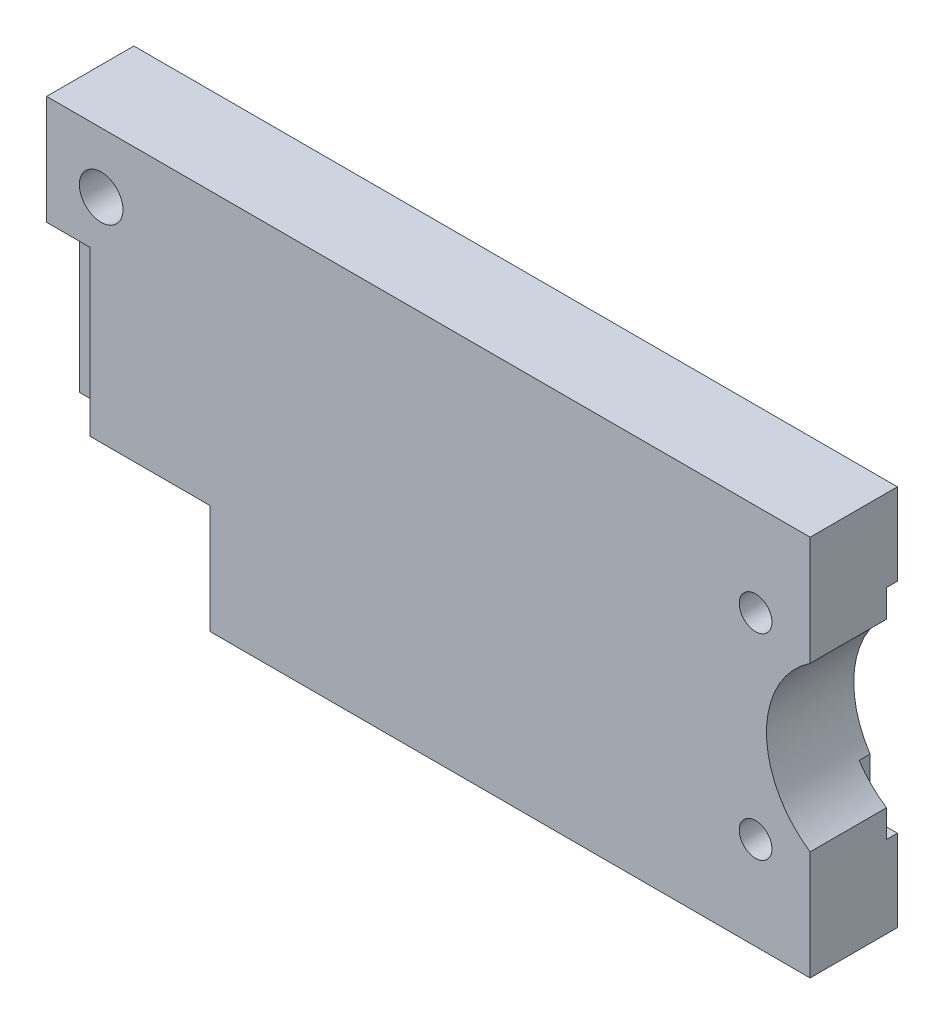
ISO-10303-21;
HEADER;
FILE_DESCRIPTION(('STEP AP214'),'2;1');
FILE_NAME('part.step','',(''),(''),'','','');
FILE_SCHEMA(('AUTOMOTIVE_DESIGN { 1 0 10303 214 1 1 1 1 }'));
ENDSEC;
DATA;
#1=APPLICATION_CONTEXT('core data for automotive mechanical design processes');
#2=APPLICATION_PROTOCOL_DEFINITION('international standard','automotive_design',2000,#1);
#3=PRODUCT_CONTEXT('',#1,'mechanical');
#4=PRODUCT('Part','Part','',(#3));
#5=PRODUCT_RELATED_PRODUCT_CATEGORY('part','',(#4));
#6=PRODUCT_DEFINITION_FORMATION('','',#4);
#7=PRODUCT_DEFINITION_CONTEXT('part definition',#1,'design');
#8=PRODUCT_DEFINITION('design','',#6,#7);
#9=PRODUCT_DEFINITION_SHAPE('','',#8);
#10=(LENGTH_UNIT() NAMED_UNIT(*) SI_UNIT(.MILLI.,.METRE.));
#11=(NAMED_UNIT(*) PLANE_ANGLE_UNIT() SI_UNIT($,.RADIAN.));
#12=(NAMED_UNIT(*) SI_UNIT($,.STERADIAN.) SOLID_ANGLE_UNIT());
#13=UNCERTAINTY_MEASURE_WITH_UNIT(LENGTH_MEASURE(1.E-05),#10,'distance_accuracy_value','');
#14=(GEOMETRIC_REPRESENTATION_CONTEXT(3) GLOBAL_UNCERTAINTY_ASSIGNED_CONTEXT((#13)) GLOBAL_UNIT_ASSIGNED_CONTEXT((#10,
#11,#12)) REPRESENTATION_CONTEXT('',''));
#15=CARTESIAN_POINT('',(0.,0.,0.));
#16=DIRECTION('',(0.,0.,1.));
#17=DIRECTION('',(1.,0.,0.));
#18=AXIS2_PLACEMENT_3D('',#15,#16,#17);
#19=CARTESIAN_POINT('',(35.,0.,4.));
#20=DIRECTION('',(1.,0.,0.));
#21=DIRECTION('',(0.,0.,-1.));
#22=AXIS2_PLACEMENT_3D('',#19,#20,#21);
#23=PLANE('',#22);
#24=DIRECTION('',(0.,0.,1.));
#25=VECTOR('',#24,1.);
#26=CARTESIAN_POINT('',(35.,7.48331477354789,-4.001));
#27=LINE('',#26,#25);
#28=CARTESIAN_POINT('',(35.,7.48331477354789,-3.));
#29=VERTEX_POINT('',#28);
#30=CARTESIAN_POINT('',(35.,7.48331477354789,4.));
#31=VERTEX_POINT('',#30);
#32=EDGE_CURVE('E157',#29,#31,#27,.T.);
#33=ORIENTED_EDGE('',*,*,#32,.F.);
#34=DIRECTION('',(0.,-1.,0.));
#35=VECTOR('',#34,1.);
#36=CARTESIAN_POINT('',(35.,10.,-3.));
#37=LINE('',#36,#35);
#38=CARTESIAN_POINT('',(35.,10.,-3.));
#39=VERTEX_POINT('',#38);
#40=EDGE_CURVE('E170',#39,#29,#37,.T.);
#41=ORIENTED_EDGE('',*,*,#40,.F.);
#42=DIRECTION('',(0.,0.,-1.));
#43=VECTOR('',#42,1.);
#44=CARTESIAN_POINT('',(35.,10.,-3.));
#45=LINE('',#44,#43);
#46=CARTESIAN_POINT('',(35.,10.,-4.));
#47=VERTEX_POINT('',#46);
#48=EDGE_CURVE('E191',#39,#47,#45,.T.);
#49=ORIENTED_EDGE('',*,*,#48,.T.);
#50=DIRECTION('',(0.,-1.,0.));
#51=VECTOR('',#50,1.);
#52=CARTESIAN_POINT('',(35.,0.,-4.));
#53=LINE('',#52,#51);
#54=CARTESIAN_POINT('',(35.,17.5,-4.));
#55=VERTEX_POINT('',#54);
#56=EDGE_CURVE('E275',#55,#47,#53,.T.);
#57=ORIENTED_EDGE('',*,*,#56,.F.);
#58=DIRECTION('',(0.,0.,-1.));
#59=VECTOR('',#58,1.);
#60=CARTESIAN_POINT('',(35.,17.5,4.));
#61=LINE('',#60,#59);
#62=CARTESIAN_POINT('',(35.,17.5,4.));
#63=VERTEX_POINT('',#62);
#64=EDGE_CURVE('E286',#63,#55,#61,.T.);
#65=ORIENTED_EDGE('',*,*,#64,.F.);
#66=DIRECTION('',(0.,-1.,0.));
#67=VECTOR('',#66,1.);
#68=CARTESIAN_POINT('',(35.,0.,4.));
#69=LINE('',#68,#67);
#70=EDGE_CURVE('E172',#63,#31,#69,.T.);
#71=ORIENTED_EDGE('',*,*,#70,.T.);
#72=EDGE_LOOP('',(#33,#41,#49,#57,#65,#71));
#73=FACE_BOUND('',#72,.T.);
#74=ADVANCED_FACE('F35',(#73),#23,.T.);
#75=CARTESIAN_POINT('',(32.5,-10.,-3.));
#76=DIRECTION('',(-1.,0.,0.));
#77=DIRECTION('',(0.,-1.,0.));
#78=AXIS2_PLACEMENT_3D('',#75,#76,#77);
#79=PLANE('',#78);
#80=DIRECTION('',(0.,1.,0.));
#81=VECTOR('',#80,1.);
#82=CARTESIAN_POINT('',(32.5,-10.,-4.));
#83=LINE('',#82,#81);
#84=CARTESIAN_POINT('',(32.5,-10.,-4.));
#85=VERTEX_POINT('',#84);
#86=CARTESIAN_POINT('',(32.5,-4.9749371855331,-4.));
#87=VERTEX_POINT('',#86);
#88=EDGE_CURVE('E197',#85,#87,#83,.T.);
#89=ORIENTED_EDGE('',*,*,#88,.T.);
#90=DIRECTION('',(0.,0.,1.));
#91=VECTOR('',#90,1.);
#92=CARTESIAN_POINT('',(32.5,-4.9749371855331,-4.001));
#93=LINE('',#92,#91);
#94=CARTESIAN_POINT('',(32.5,-4.97493718553311,-3.));
#95=VERTEX_POINT('',#94);
#96=EDGE_CURVE('E337',#95,#87,#93,.F.);
#97=ORIENTED_EDGE('',*,*,#96,.F.);
#98=DIRECTION('',(0.,1.,0.));
#99=VECTOR('',#98,1.);
#100=CARTESIAN_POINT('',(32.5,-10.,-3.));
#101=LINE('',#100,#99);
#102=CARTESIAN_POINT('',(32.5,-10.,-3.));
#103=VERTEX_POINT('',#102);
#104=EDGE_CURVE('E188',#103,#95,#101,.T.);
#105=ORIENTED_EDGE('',*,*,#104,.F.);
#106=DIRECTION('',(0.,0.,-1.));
#107=VECTOR('',#106,1.);
#108=CARTESIAN_POINT('',(32.5,-10.,-3.));
#109=LINE('',#108,#107);
#110=EDGE_CURVE('E204',#103,#85,#109,.T.);
#111=ORIENTED_EDGE('',*,*,#110,.T.);
#112=EDGE_LOOP('',(#89,#97,#105,#111));
#113=FACE_BOUND('',#112,.T.);
#114=ADVANCED_FACE('F341',(#113),#79,.F.);
#115=CARTESIAN_POINT('',(0.,0.,-3.));
#116=DIRECTION('',(0.,0.,-1.));
#117=DIRECTION('',(-1.,0.,0.));
#118=AXIS2_PLACEMENT_3D('',#115,#116,#117);
#119=PLANE('',#118);
#120=CARTESIAN_POINT('',(40.,0.,-3.));
#121=DIRECTION('',(0.,0.,-1.));
#122=DIRECTION('',(-1.,0.,0.));
#123=AXIS2_PLACEMENT_3D('',#120,#121,#122);
#124=CIRCLE('',#123,9.);
#125=CARTESIAN_POINT('',(32.5,4.97493718553311,-3.));
#126=VERTEX_POINT('',#125);
#127=EDGE_CURVE('E154',#29,#126,#124,.F.);
#128=ORIENTED_EDGE('',*,*,#127,.T.);
#129=CARTESIAN_POINT('',(32.5,10.,-3.));
#130=VERTEX_POINT('',#129);
#131=EDGE_CURVE('E183',#126,#130,#101,.T.);
#132=ORIENTED_EDGE('',*,*,#131,.T.);
#133=DIRECTION('',(1.,0.,0.));
#134=VECTOR('',#133,1.);
#135=CARTESIAN_POINT('',(32.5,10.,-3.));
#136=LINE('',#135,#134);
#137=EDGE_CURVE('E178',#130,#39,#136,.T.);
#138=ORIENTED_EDGE('',*,*,#137,.T.);
#139=ORIENTED_EDGE('',*,*,#40,.T.);
#140=EDGE_LOOP('',(#128,#132,#138,#139));
#141=FACE_BOUND('',#140,.T.);
#142=ADVANCED_FACE('F176',(#141),#119,.T.);
#143=CARTESIAN_POINT('',(0.,-7.50000000000001,4.));
#144=DIRECTION('',(0.,1.,0.));
#145=DIRECTION('',(0.,0.,1.));
#146=AXIS2_PLACEMENT_3D('',#143,#144,#145);
#147=PLANE('',#146);
#148=DIRECTION('',(0.,0.,1.));
#149=VECTOR('',#148,1.);
#150=CARTESIAN_POINT('',(-31.,-7.50000000000001,1.));
#151=LINE('',#150,#149);
#152=CARTESIAN_POINT('',(-31.,-7.50000000000001,1.));
#153=VERTEX_POINT('',#152);
#154=CARTESIAN_POINT('',(-31.,-7.50000000000001,4.));
#155=VERTEX_POINT('',#154);
#156=EDGE_CURVE('E226',#153,#155,#151,.T.);
#157=ORIENTED_EDGE('',*,*,#156,.F.);
#158=DIRECTION('',(1.,0.,0.));
#159=VECTOR('',#158,1.);
#160=CARTESIAN_POINT('',(-35.,-7.5,1.));
#161=LINE('',#160,#159);
#162=CARTESIAN_POINT('',(-35.,-7.5,1.));
#163=VERTEX_POINT('',#162);
#164=EDGE_CURVE('E214',#163,#153,#161,.T.);
#165=ORIENTED_EDGE('',*,*,#164,.F.);
#166=DIRECTION('',(0.,0.,-1.));
#167=VECTOR('',#166,1.);
#168=CARTESIAN_POINT('',(-35.,-7.50000000000001,4.));
#169=LINE('',#168,#167);
#170=CARTESIAN_POINT('',(-35.,-7.50000000000001,-4.));
#171=VERTEX_POINT('',#170);
#172=EDGE_CURVE('E256',#163,#171,#169,.T.);
#173=ORIENTED_EDGE('',*,*,#172,.T.);
#174=DIRECTION('',(1.,0.,0.));
#175=VECTOR('',#174,1.);
#176=CARTESIAN_POINT('',(0.,-7.50000000000001,-4.));
#177=LINE('',#176,#175);
#178=CARTESIAN_POINT('',(-20.,-7.50000000000001,-4.));
#179=VERTEX_POINT('',#178);
#180=EDGE_CURVE('E265',#171,#179,#177,.T.);
#181=ORIENTED_EDGE('',*,*,#180,.T.);
#182=DIRECTION('',(0.,0.,-1.));
#183=VECTOR('',#182,1.);
#184=CARTESIAN_POINT('',(-20.,-7.50000000000001,4.));
#185=LINE('',#184,#183);
#186=CARTESIAN_POINT('',(-20.,-7.50000000000001,4.));
#187=VERTEX_POINT('',#186);
#188=EDGE_CURVE('E11',#187,#179,#185,.T.);
#189=ORIENTED_EDGE('',*,*,#188,.F.);
#190=DIRECTION('',(1.,0.,0.));
#191=VECTOR('',#190,1.);
#192=CARTESIAN_POINT('',(0.,-7.50000000000001,4.));
#193=LINE('',#192,#191);
#194=EDGE_CURVE('E242',#155,#187,#193,.T.);
#195=ORIENTED_EDGE('',*,*,#194,.F.);
#196=EDGE_LOOP('',(#157,#165,#173,#181,#189,#195));
#197=FACE_BOUND('',#196,.T.);
#198=ADVANCED_FACE('F315',(#197),#147,.F.);
#199=CARTESIAN_POINT('',(-35.,0.,4.));
#200=DIRECTION('',(-1.,0.,0.));
#201=DIRECTION('',(0.,0.,1.));
#202=AXIS2_PLACEMENT_3D('',#199,#200,#201);
#203=PLANE('',#202);
#204=DIRECTION('',(0.,-1.,0.));
#205=VECTOR('',#204,1.);
#206=CARTESIAN_POINT('',(-35.,7.5,1.));
#207=LINE('',#206,#205);
#208=CARTESIAN_POINT('',(-35.,7.5,1.));
#209=VERTEX_POINT('',#208);
#210=EDGE_CURVE('E217',#209,#163,#207,.T.);
#211=ORIENTED_EDGE('',*,*,#210,.F.);
#212=DIRECTION('',(0.,0.,1.));
#213=VECTOR('',#212,1.);
#214=CARTESIAN_POINT('',(-35.,7.5,1.));
#215=LINE('',#214,#213);
#216=CARTESIAN_POINT('',(-35.,7.5,4.));
#217=VERTEX_POINT('',#216);
#218=EDGE_CURVE('E219',#209,#217,#215,.T.);
#219=ORIENTED_EDGE('',*,*,#218,.T.);
#220=DIRECTION('',(0.,1.,0.));
#221=VECTOR('',#220,1.);
#222=CARTESIAN_POINT('',(-35.,0.,4.));
#223=LINE('',#222,#221);
#224=CARTESIAN_POINT('',(-35.,17.5,4.));
#225=VERTEX_POINT('',#224);
#226=EDGE_CURVE('E254',#217,#225,#223,.T.);
#227=ORIENTED_EDGE('',*,*,#226,.T.);
#228=DIRECTION('',(0.,0.,-1.));
#229=VECTOR('',#228,1.);
#230=CARTESIAN_POINT('',(-35.,17.5,4.));
#231=LINE('',#230,#229);
#232=CARTESIAN_POINT('',(-35.,17.5,-4.));
#233=VERTEX_POINT('',#232);
#234=EDGE_CURVE('E284',#225,#233,#231,.T.);
#235=ORIENTED_EDGE('',*,*,#234,.T.);
#236=DIRECTION('',(0.,1.,0.));
#237=VECTOR('',#236,1.);
#238=CARTESIAN_POINT('',(-35.,0.,-4.));
#239=LINE('',#238,#237);
#240=EDGE_CURVE('E236',#171,#233,#239,.T.);
#241=ORIENTED_EDGE('',*,*,#240,.F.);
#242=ORIENTED_EDGE('',*,*,#172,.F.);
#243=EDGE_LOOP('',(#211,#219,#227,#235,#241,#242));
#244=FACE_BOUND('',#243,.T.);
#245=ADVANCED_FACE('F321',(#244),#203,.T.);
#246=CARTESIAN_POINT('',(0.,0.,4.));
#247=DIRECTION('',(0.,0.,1.));
#248=DIRECTION('',(1.,0.,0.));
#249=AXIS2_PLACEMENT_3D('',#246,#247,#248);
#250=PLANE('',#249);
#251=CARTESIAN_POINT('',(40.,0.,4.));
#252=DIRECTION('',(0.,0.,1.));
#253=DIRECTION('',(1.,0.,0.));
#254=AXIS2_PLACEMENT_3D('',#251,#252,#253);
#255=CIRCLE('',#254,9.);
#256=CARTESIAN_POINT('',(35.,-7.48331477354789,4.));
#257=VERTEX_POINT('',#256);
#258=EDGE_CURVE('E173',#31,#257,#255,.T.);
#259=ORIENTED_EDGE('',*,*,#258,.F.);
#260=ORIENTED_EDGE('',*,*,#70,.F.);
#261=DIRECTION('',(1.,0.,0.));
#262=VECTOR('',#261,1.);
#263=CARTESIAN_POINT('',(0.,17.5,4.));
#264=LINE('',#263,#262);
#265=EDGE_CURVE('E251',#225,#63,#264,.T.);
#266=ORIENTED_EDGE('',*,*,#265,.F.);
#267=ORIENTED_EDGE('',*,*,#226,.F.);
#268=DIRECTION('',(1.,0.,0.));
#269=VECTOR('',#268,1.);
#270=CARTESIAN_POINT('',(-35.,7.5,4.));
#271=LINE('',#270,#269);
#272=CARTESIAN_POINT('',(-31.,7.5,4.));
#273=VERTEX_POINT('',#272);
#274=EDGE_CURVE('E203',#217,#273,#271,.T.);
#275=ORIENTED_EDGE('',*,*,#274,.T.);
#276=DIRECTION('',(0.,-1.,0.));
#277=VECTOR('',#276,1.);
#278=CARTESIAN_POINT('',(-31.,7.5,4.));
#279=LINE('',#278,#277);
#280=EDGE_CURVE('E212',#273,#155,#279,.T.);
#281=ORIENTED_EDGE('',*,*,#280,.T.);
#282=ORIENTED_EDGE('',*,*,#194,.T.);
#283=DIRECTION('',(0.,-1.,0.));
#284=VECTOR('',#283,1.);
#285=CARTESIAN_POINT('',(-20.,0.,4.));
#286=LINE('',#285,#284);
#287=CARTESIAN_POINT('',(-20.,-17.5,4.));
#288=VERTEX_POINT('',#287);
#289=EDGE_CURVE('E244',#187,#288,#286,.T.);
#290=ORIENTED_EDGE('',*,*,#289,.T.);
#291=DIRECTION('',(-1.,0.,0.));
#292=VECTOR('',#291,1.);
#293=CARTESIAN_POINT('',(0.,-17.5,4.));
#294=LINE('',#293,#292);
#295=CARTESIAN_POINT('',(35.,-17.5,4.));
#296=VERTEX_POINT('',#295);
#297=EDGE_CURVE('E246',#296,#288,#294,.T.);
#298=ORIENTED_EDGE('',*,*,#297,.F.);
#299=EDGE_CURVE('E249',#257,#296,#69,.T.);
#300=ORIENTED_EDGE('',*,*,#299,.F.);
#301=EDGE_LOOP('',(#259,#260,#266,#267,#275,#281,#282,#290,#298,#300));
#302=FACE_BOUND('',#301,.T.);
#303=CARTESIAN_POINT('',(30.,-9.,4.));
#304=DIRECTION('',(0.,0.,1.));
#305=DIRECTION('',(1.,0.,0.));
#306=AXIS2_PLACEMENT_3D('',#303,#304,#305);
#307=CIRCLE('',#306,1.50000000000001);
#308=CARTESIAN_POINT('',(31.5,-9.,4.));
#309=VERTEX_POINT('',#308);
#310=EDGE_CURVE('E232',#309,#309,#307,.T.);
#311=ORIENTED_EDGE('',*,*,#310,.F.);
#312=EDGE_LOOP('',(#311));
#313=FACE_BOUND('',#312,.T.);
#314=CARTESIAN_POINT('',(30.,9.,4.));
#315=DIRECTION('',(0.,0.,1.));
#316=DIRECTION('',(1.,0.,0.));
#317=AXIS2_PLACEMENT_3D('',#314,#315,#316);
#318=CIRCLE('',#317,1.50000000000001);
#319=CARTESIAN_POINT('',(31.5,9.,4.));
#320=VERTEX_POINT('',#319);
#321=EDGE_CURVE('E235',#320,#320,#318,.T.);
#322=ORIENTED_EDGE('',*,*,#321,.F.);
#323=EDGE_LOOP('',(#322));
#324=FACE_BOUND('',#323,.T.);
#325=CARTESIAN_POINT('',(-30.,12.,4.));
#326=DIRECTION('',(0.,0.,1.));
#327=DIRECTION('',(1.,0.,0.));
#328=AXIS2_PLACEMENT_3D('',#325,#326,#327);
#329=CIRCLE('',#328,2.);
#330=CARTESIAN_POINT('',(-28.,12.,4.));
#331=VERTEX_POINT('',#330);
#332=EDGE_CURVE('E239',#331,#331,#329,.T.);
#333=ORIENTED_EDGE('',*,*,#332,.F.);
#334=EDGE_LOOP('',(#333));
#335=FACE_BOUND('',#334,.T.);
#336=ADVANCED_FACE('F310',(#302,#313,#324,#335),#250,.T.);
#337=CARTESIAN_POINT('',(-20.,0.,4.));
#338=DIRECTION('',(1.,0.,0.));
#339=DIRECTION('',(0.,1.,0.));
#340=AXIS2_PLACEMENT_3D('',#337,#338,#339);
#341=PLANE('',#340);
#342=DIRECTION('',(0.,-1.,0.));
#343=VECTOR('',#342,1.);
#344=CARTESIAN_POINT('',(-20.,0.,-4.));
#345=LINE('',#344,#343);
#346=CARTESIAN_POINT('',(-20.,-17.5,-4.));
#347=VERTEX_POINT('',#346);
#348=EDGE_CURVE('E268',#179,#347,#345,.T.);
#349=ORIENTED_EDGE('',*,*,#348,.T.);
#350=DIRECTION('',(0.,0.,-1.));
#351=VECTOR('',#350,1.);
#352=CARTESIAN_POINT('',(-20.,-17.5,4.));
#353=LINE('',#352,#351);
#354=EDGE_CURVE('E43',#288,#347,#353,.T.);
#355=ORIENTED_EDGE('',*,*,#354,.F.);
#356=ORIENTED_EDGE('',*,*,#289,.F.);
#357=ORIENTED_EDGE('',*,*,#188,.T.);
#358=EDGE_LOOP('',(#349,#355,#356,#357));
#359=FACE_BOUND('',#358,.T.);
#360=ADVANCED_FACE('F298',(#359),#341,.F.);
#361=CARTESIAN_POINT('',(0.,-17.5,4.));
#362=DIRECTION('',(0.,-1.,0.));
#363=DIRECTION('',(0.,0.,-1.));
#364=AXIS2_PLACEMENT_3D('',#361,#362,#363);
#365=PLANE('',#364);
#366=DIRECTION('',(-1.,0.,0.));
#367=VECTOR('',#366,1.);
#368=CARTESIAN_POINT('',(0.,-17.5,-4.));
#369=LINE('',#368,#367);
#370=CARTESIAN_POINT('',(35.,-17.5,-4.));
#371=VERTEX_POINT('',#370);
#372=EDGE_CURVE('E271',#371,#347,#369,.T.);
#373=ORIENTED_EDGE('',*,*,#372,.F.);
#374=DIRECTION('',(0.,0.,-1.));
#375=VECTOR('',#374,1.);
#376=CARTESIAN_POINT('',(35.,-17.5,4.));
#377=LINE('',#376,#375);
#378=EDGE_CURVE('E288',#296,#371,#377,.T.);
#379=ORIENTED_EDGE('',*,*,#378,.F.);
#380=ORIENTED_EDGE('',*,*,#297,.T.);
#381=ORIENTED_EDGE('',*,*,#354,.T.);
#382=EDGE_LOOP('',(#373,#379,#380,#381));
#383=FACE_BOUND('',#382,.T.);
#384=ADVANCED_FACE('F293',(#383),#365,.T.);
#385=DIRECTION('',(0.,0.,1.));
#386=VECTOR('',#385,1.);
#387=CARTESIAN_POINT('',(35.,-7.48331477354789,-4.001));
#388=LINE('',#387,#386);
#389=CARTESIAN_POINT('',(35.,-7.48331477354789,-3.));
#390=VERTEX_POINT('',#389);
#391=EDGE_CURVE('E50',#390,#257,#388,.T.);
#392=ORIENTED_EDGE('',*,*,#391,.T.);
#393=ORIENTED_EDGE('',*,*,#299,.T.);
#394=ORIENTED_EDGE('',*,*,#378,.T.);
#395=CARTESIAN_POINT('',(35.,-10.,-4.));
#396=VERTEX_POINT('',#395);
#397=EDGE_CURVE('E274',#396,#371,#53,.T.);
#398=ORIENTED_EDGE('',*,*,#397,.F.);
#399=DIRECTION('',(0.,0.,-1.));
#400=VECTOR('',#399,1.);
#401=CARTESIAN_POINT('',(35.,-10.,-3.));
#402=LINE('',#401,#400);
#403=CARTESIAN_POINT('',(35.,-10.,-3.));
#404=VERTEX_POINT('',#403);
#405=EDGE_CURVE('E58',#404,#396,#402,.T.);
#406=ORIENTED_EDGE('',*,*,#405,.F.);
#407=EDGE_CURVE('E180',#390,#404,#37,.T.);
#408=ORIENTED_EDGE('',*,*,#407,.F.);
#409=EDGE_LOOP('',(#392,#393,#394,#398,#406,#408));
#410=FACE_BOUND('',#409,.T.);
#411=ADVANCED_FACE('F307',(#410),#23,.T.);
#412=CARTESIAN_POINT('',(0.,17.5,4.));
#413=DIRECTION('',(0.,1.,0.));
#414=DIRECTION('',(-1.,0.,0.));
#415=AXIS2_PLACEMENT_3D('',#412,#413,#414);
#416=PLANE('',#415);
#417=DIRECTION('',(1.,0.,0.));
#418=VECTOR('',#417,1.);
#419=CARTESIAN_POINT('',(0.,17.5,-4.));
#420=LINE('',#419,#418);
#421=EDGE_CURVE('E278',#233,#55,#420,.T.);
#422=ORIENTED_EDGE('',*,*,#421,.F.);
#423=ORIENTED_EDGE('',*,*,#234,.F.);
#424=ORIENTED_EDGE('',*,*,#265,.T.);
#425=ORIENTED_EDGE('',*,*,#64,.T.);
#426=EDGE_LOOP('',(#422,#423,#424,#425));
#427=FACE_BOUND('',#426,.T.);
#428=ADVANCED_FACE('F327',(#427),#416,.T.);
#429=CARTESIAN_POINT('',(-30.,12.,4.));
#430=DIRECTION('',(0.,0.,-1.));
#431=DIRECTION('',(-1.,0.,0.));
#432=AXIS2_PLACEMENT_3D('',#429,#430,#431);
#433=CYLINDRICAL_SURFACE('',#432,2.);
#434=ORIENTED_EDGE('',*,*,#332,.T.);
#435=EDGE_LOOP('',(#434));
#436=FACE_BOUND('',#435,.T.);
#437=CARTESIAN_POINT('',(-30.,12.,-4.));
#438=DIRECTION('',(0.,0.,1.));
#439=DIRECTION('',(1.,0.,0.));
#440=AXIS2_PLACEMENT_3D('',#437,#438,#439);
#441=CIRCLE('',#440,2.);
#442=CARTESIAN_POINT('',(-28.,12.,-4.));
#443=VERTEX_POINT('',#442);
#444=EDGE_CURVE('E262',#443,#443,#441,.T.);
#445=ORIENTED_EDGE('',*,*,#444,.F.);
#446=EDGE_LOOP('',(#445));
#447=FACE_BOUND('',#446,.T.);
#448=ADVANCED_FACE('F367',(#436,#447),#433,.F.);
#449=CARTESIAN_POINT('',(30.,9.,4.));
#450=DIRECTION('',(0.,0.,-1.));
#451=DIRECTION('',(-1.,0.,0.));
#452=AXIS2_PLACEMENT_3D('',#449,#450,#451);
#453=CYLINDRICAL_SURFACE('',#452,1.50000000000001);
#454=ORIENTED_EDGE('',*,*,#321,.T.);
#455=EDGE_LOOP('',(#454));
#456=FACE_BOUND('',#455,.T.);
#457=CARTESIAN_POINT('',(30.,9.,-4.));
#458=DIRECTION('',(0.,0.,1.));
#459=DIRECTION('',(1.,0.,0.));
#460=AXIS2_PLACEMENT_3D('',#457,#458,#459);
#461=CIRCLE('',#460,1.50000000000001);
#462=CARTESIAN_POINT('',(31.5,9.,-4.));
#463=VERTEX_POINT('',#462);
#464=EDGE_CURVE('E259',#463,#463,#461,.T.);
#465=ORIENTED_EDGE('',*,*,#464,.F.);
#466=EDGE_LOOP('',(#465));
#467=FACE_BOUND('',#466,.T.);
#468=ADVANCED_FACE('F376',(#456,#467),#453,.F.);
#469=CARTESIAN_POINT('',(30.,-9.,4.));
#470=DIRECTION('',(0.,0.,-1.));
#471=DIRECTION('',(-1.,0.,0.));
#472=AXIS2_PLACEMENT_3D('',#469,#470,#471);
#473=CYLINDRICAL_SURFACE('',#472,1.50000000000001);
#474=ORIENTED_EDGE('',*,*,#310,.T.);
#475=EDGE_LOOP('',(#474));
#476=FACE_BOUND('',#475,.T.);
#477=CARTESIAN_POINT('',(30.,-9.,-4.));
#478=DIRECTION('',(0.,0.,1.));
#479=DIRECTION('',(1.,0.,0.));
#480=AXIS2_PLACEMENT_3D('',#477,#478,#479);
#481=CIRCLE('',#480,1.50000000000001);
#482=CARTESIAN_POINT('',(31.5,-9.,-4.));
#483=VERTEX_POINT('',#482);
#484=EDGE_CURVE('E231',#483,#483,#481,.T.);
#485=ORIENTED_EDGE('',*,*,#484,.F.);
#486=EDGE_LOOP('',(#485));
#487=FACE_BOUND('',#486,.T.);
#488=ADVANCED_FACE('F37',(#476,#487),#473,.F.);
#489=CARTESIAN_POINT('',(0.,0.,-4.));
#490=DIRECTION('',(0.,0.,1.));
#491=DIRECTION('',(1.,0.,0.));
#492=AXIS2_PLACEMENT_3D('',#489,#490,#491);
#493=PLANE('',#492);
#494=ORIENTED_EDGE('',*,*,#484,.T.);
#495=EDGE_LOOP('',(#494));
#496=FACE_BOUND('',#495,.T.);
#497=ORIENTED_EDGE('',*,*,#464,.T.);
#498=EDGE_LOOP('',(#497));
#499=FACE_BOUND('',#498,.T.);
#500=ORIENTED_EDGE('',*,*,#444,.T.);
#501=EDGE_LOOP('',(#500));
#502=FACE_BOUND('',#501,.T.);
#503=CARTESIAN_POINT('',(32.5,4.97493718553311,-4.));
#504=VERTEX_POINT('',#503);
#505=CARTESIAN_POINT('',(32.5,10.,-4.));
#506=VERTEX_POINT('',#505);
#507=EDGE_CURVE('E196',#504,#506,#83,.T.);
#508=ORIENTED_EDGE('',*,*,#507,.F.);
#509=CARTESIAN_POINT('',(40.,0.,-4.));
#510=DIRECTION('',(0.,0.,1.));
#511=DIRECTION('',(1.,0.,0.));
#512=AXIS2_PLACEMENT_3D('',#509,#510,#511);
#513=CIRCLE('',#512,9.);
#514=EDGE_CURVE('E336',#87,#504,#513,.F.);
#515=ORIENTED_EDGE('',*,*,#514,.F.);
#516=ORIENTED_EDGE('',*,*,#88,.F.);
#517=DIRECTION('',(-1.,0.,0.));
#518=VECTOR('',#517,1.);
#519=CARTESIAN_POINT('',(35.,-10.,-4.));
#520=LINE('',#519,#518);
#521=EDGE_CURVE('E194',#396,#85,#520,.T.);
#522=ORIENTED_EDGE('',*,*,#521,.F.);
#523=ORIENTED_EDGE('',*,*,#397,.T.);
#524=ORIENTED_EDGE('',*,*,#372,.T.);
#525=ORIENTED_EDGE('',*,*,#348,.F.);
#526=ORIENTED_EDGE('',*,*,#180,.F.);
#527=ORIENTED_EDGE('',*,*,#240,.T.);
#528=ORIENTED_EDGE('',*,*,#421,.T.);
#529=ORIENTED_EDGE('',*,*,#56,.T.);
#530=DIRECTION('',(1.,0.,0.));
#531=VECTOR('',#530,1.);
#532=CARTESIAN_POINT('',(32.5,10.,-4.));
#533=LINE('',#532,#531);
#534=EDGE_CURVE('E192',#506,#47,#533,.T.);
#535=ORIENTED_EDGE('',*,*,#534,.F.);
#536=EDGE_LOOP('',(#508,#515,#516,#522,#523,#524,#525,#526,#527,#528,#529,#535));
#537=FACE_BOUND('',#536,.T.);
#538=ADVANCED_FACE('F303',(#496,#499,#502,#537),#493,.F.);
#539=CARTESIAN_POINT('',(-35.,7.5,1.));
#540=DIRECTION('',(0.,-1.,0.));
#541=DIRECTION('',(0.,0.,-1.));
#542=AXIS2_PLACEMENT_3D('',#539,#540,#541);
#543=PLANE('',#542);
#544=ORIENTED_EDGE('',*,*,#274,.F.);
#545=ORIENTED_EDGE('',*,*,#218,.F.);
#546=DIRECTION('',(1.,0.,0.));
#547=VECTOR('',#546,1.);
#548=CARTESIAN_POINT('',(-35.,7.5,1.));
#549=LINE('',#548,#547);
#550=CARTESIAN_POINT('',(-31.,7.5,1.));
#551=VERTEX_POINT('',#550);
#552=EDGE_CURVE('E208',#209,#551,#549,.T.);
#553=ORIENTED_EDGE('',*,*,#552,.T.);
#554=DIRECTION('',(0.,0.,1.));
#555=VECTOR('',#554,1.);
#556=CARTESIAN_POINT('',(-31.,7.5,1.));
#557=LINE('',#556,#555);
#558=EDGE_CURVE('E228',#551,#273,#557,.T.);
#559=ORIENTED_EDGE('',*,*,#558,.T.);
#560=EDGE_LOOP('',(#544,#545,#553,#559));
#561=FACE_BOUND('',#560,.T.);
#562=ADVANCED_FACE('F390',(#561),#543,.T.);
#563=CARTESIAN_POINT('',(-31.,7.5,1.));
#564=DIRECTION('',(-1.,0.,0.));
#565=DIRECTION('',(0.,0.,1.));
#566=AXIS2_PLACEMENT_3D('',#563,#564,#565);
#567=PLANE('',#566);
#568=ORIENTED_EDGE('',*,*,#280,.F.);
#569=ORIENTED_EDGE('',*,*,#558,.F.);
#570=DIRECTION('',(0.,-1.,0.));
#571=VECTOR('',#570,1.);
#572=CARTESIAN_POINT('',(-31.,7.5,1.));
#573=LINE('',#572,#571);
#574=EDGE_CURVE('E211',#551,#153,#573,.T.);
#575=ORIENTED_EDGE('',*,*,#574,.T.);
#576=ORIENTED_EDGE('',*,*,#156,.T.);
#577=EDGE_LOOP('',(#568,#569,#575,#576));
#578=FACE_BOUND('',#577,.T.);
#579=ADVANCED_FACE('F398',(#578),#567,.T.);
#580=CARTESIAN_POINT('',(0.,0.,1.));
#581=DIRECTION('',(0.,0.,-1.));
#582=DIRECTION('',(-1.,0.,0.));
#583=AXIS2_PLACEMENT_3D('',#580,#581,#582);
#584=PLANE('',#583);
#585=ORIENTED_EDGE('',*,*,#552,.F.);
#586=ORIENTED_EDGE('',*,*,#210,.T.);
#587=ORIENTED_EDGE('',*,*,#164,.T.);
#588=ORIENTED_EDGE('',*,*,#574,.F.);
#589=EDGE_LOOP('',(#585,#586,#587,#588));
#590=FACE_BOUND('',#589,.T.);
#591=ADVANCED_FACE('F468',(#590),#584,.F.);
#592=CARTESIAN_POINT('',(32.5,10.,-3.));
#593=DIRECTION('',(0.,1.,0.));
#594=DIRECTION('',(-1.,0.,0.));
#595=AXIS2_PLACEMENT_3D('',#592,#593,#594);
#596=PLANE('',#595);
#597=ORIENTED_EDGE('',*,*,#534,.T.);
#598=ORIENTED_EDGE('',*,*,#48,.F.);
#599=ORIENTED_EDGE('',*,*,#137,.F.);
#600=DIRECTION('',(0.,0.,-1.));
#601=VECTOR('',#600,1.);
#602=CARTESIAN_POINT('',(32.5,10.,-3.));
#603=LINE('',#602,#601);
#604=EDGE_CURVE('E200',#130,#506,#603,.T.);
#605=ORIENTED_EDGE('',*,*,#604,.T.);
#606=EDGE_LOOP('',(#597,#598,#599,#605));
#607=FACE_BOUND('',#606,.T.);
#608=ADVANCED_FACE('F331',(#607),#596,.F.);
#609=ORIENTED_EDGE('',*,*,#131,.F.);
#610=DIRECTION('',(0.,0.,1.));
#611=VECTOR('',#610,1.);
#612=CARTESIAN_POINT('',(32.5,4.97493718553311,-4.001));
#613=LINE('',#612,#611);
#614=EDGE_CURVE('E160',#504,#126,#613,.T.);
#615=ORIENTED_EDGE('',*,*,#614,.F.);
#616=ORIENTED_EDGE('',*,*,#507,.T.);
#617=ORIENTED_EDGE('',*,*,#604,.F.);
#618=EDGE_LOOP('',(#609,#615,#616,#617));
#619=FACE_BOUND('',#618,.T.);
#620=ADVANCED_FACE('F334',(#619),#79,.F.);
#621=CARTESIAN_POINT('',(35.,-10.,-3.));
#622=DIRECTION('',(0.,-1.,0.));
#623=DIRECTION('',(1.,0.,0.));
#624=AXIS2_PLACEMENT_3D('',#621,#622,#623);
#625=PLANE('',#624);
#626=ORIENTED_EDGE('',*,*,#521,.T.);
#627=ORIENTED_EDGE('',*,*,#110,.F.);
#628=DIRECTION('',(-1.,0.,0.));
#629=VECTOR('',#628,1.);
#630=CARTESIAN_POINT('',(35.,-10.,-3.));
#631=LINE('',#630,#629);
#632=EDGE_CURVE('E179',#404,#103,#631,.T.);
#633=ORIENTED_EDGE('',*,*,#632,.F.);
#634=ORIENTED_EDGE('',*,*,#405,.T.);
#635=EDGE_LOOP('',(#626,#627,#633,#634));
#636=FACE_BOUND('',#635,.T.);
#637=ADVANCED_FACE('F343',(#636),#625,.F.);
#638=EDGE_CURVE('E165',#95,#390,#124,.F.);
#639=ORIENTED_EDGE('',*,*,#638,.T.);
#640=ORIENTED_EDGE('',*,*,#407,.T.);
#641=ORIENTED_EDGE('',*,*,#632,.T.);
#642=ORIENTED_EDGE('',*,*,#104,.T.);
#643=EDGE_LOOP('',(#639,#640,#641,#642));
#644=FACE_BOUND('',#643,.T.);
#645=ADVANCED_FACE('F345',(#644),#119,.T.);
#646=CARTESIAN_POINT('',(40.,0.,-4.001));
#647=DIRECTION('',(0.,0.,1.));
#648=DIRECTION('',(1.,0.,0.));
#649=AXIS2_PLACEMENT_3D('',#646,#647,#648);
#650=CYLINDRICAL_SURFACE('',#649,9.);
#651=ORIENTED_EDGE('',*,*,#96,.T.);
#652=ORIENTED_EDGE('',*,*,#514,.T.);
#653=ORIENTED_EDGE('',*,*,#614,.T.);
#654=ORIENTED_EDGE('',*,*,#127,.F.);
#655=ORIENTED_EDGE('',*,*,#32,.T.);
#656=ORIENTED_EDGE('',*,*,#258,.T.);
#657=ORIENTED_EDGE('',*,*,#391,.F.);
#658=ORIENTED_EDGE('',*,*,#638,.F.);
#659=EDGE_LOOP('',(#651,#652,#653,#654,#655,#656,#657,#658));
#660=FACE_BOUND('',#659,.T.);
#661=ADVANCED_FACE('F156',(#660),#650,.F.);
#662=CLOSED_SHELL('',(#74,#114,#142,#198,#245,#336,#360,#384,#411,#428,#448,#468,#488,#538,#562,
#579,#591,#608,#620,#637,#645,#661));
#663=MANIFOLD_SOLID_BREP('B2',#662);
#664=ADVANCED_BREP_SHAPE_REPRESENTATION('',(#18,#663),#14);
#665=SHAPE_DEFINITION_REPRESENTATION(#9,#664);
ENDSEC;
END-ISO-10303-21;
